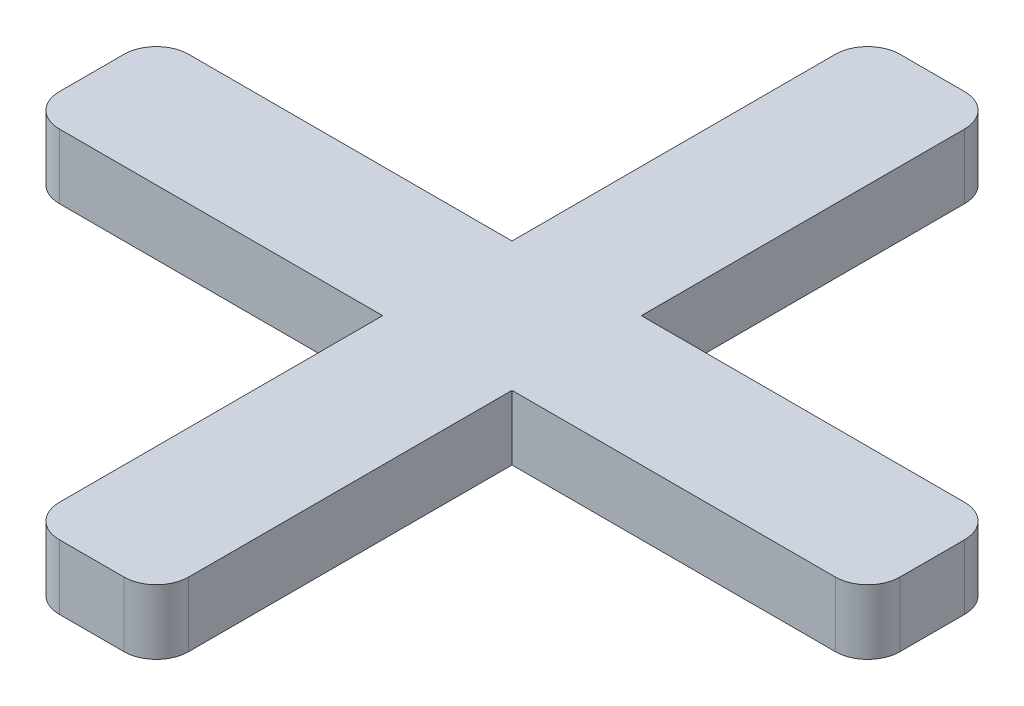
ISO-10303-21;
HEADER;
FILE_DESCRIPTION(('STEP AP214'),'2;1');
FILE_NAME('part.step','',(''),(''),'','','');
FILE_SCHEMA(('AUTOMOTIVE_DESIGN { 1 0 10303 214 1 1 1 1 }'));
ENDSEC;
DATA;
#1=APPLICATION_CONTEXT('core data for automotive mechanical design processes');
#2=APPLICATION_PROTOCOL_DEFINITION('international standard','automotive_design',2000,#1);
#3=PRODUCT_CONTEXT('',#1,'mechanical');
#4=PRODUCT('Part','Part','',(#3));
#5=PRODUCT_RELATED_PRODUCT_CATEGORY('part','',(#4));
#6=PRODUCT_DEFINITION_FORMATION('','',#4);
#7=PRODUCT_DEFINITION_CONTEXT('part definition',#1,'design');
#8=PRODUCT_DEFINITION('design','',#6,#7);
#9=PRODUCT_DEFINITION_SHAPE('','',#8);
#10=(LENGTH_UNIT() NAMED_UNIT(*) SI_UNIT(.MILLI.,.METRE.));
#11=(NAMED_UNIT(*) PLANE_ANGLE_UNIT() SI_UNIT($,.RADIAN.));
#12=(NAMED_UNIT(*) SI_UNIT($,.STERADIAN.) SOLID_ANGLE_UNIT());
#13=UNCERTAINTY_MEASURE_WITH_UNIT(LENGTH_MEASURE(1.E-05),#10,'distance_accuracy_value','');
#14=(GEOMETRIC_REPRESENTATION_CONTEXT(3) GLOBAL_UNCERTAINTY_ASSIGNED_CONTEXT((#13)) GLOBAL_UNIT_ASSIGNED_CONTEXT((#10,
#11,#12)) REPRESENTATION_CONTEXT('',''));
#15=CARTESIAN_POINT('',(0.,0.,0.));
#16=DIRECTION('',(0.,0.,1.));
#17=DIRECTION('',(1.,0.,0.));
#18=AXIS2_PLACEMENT_3D('',#15,#16,#17);
#19=CARTESIAN_POINT('',(-0.500000000000002,1.,-6.));
#20=DIRECTION('',(0.,-1.,0.));
#21=DIRECTION('',(0.,0.,-1.));
#22=AXIS2_PLACEMENT_3D('',#19,#20,#21);
#23=CYLINDRICAL_SURFACE('',#22,0.5);
#24=CARTESIAN_POINT('',(-0.500000000000002,0.,-6.));
#25=DIRECTION('',(0.,1.,0.));
#26=DIRECTION('',(0.,0.,-1.));
#27=AXIS2_PLACEMENT_3D('',#24,#25,#26);
#28=CIRCLE('',#27,0.5);
#29=CARTESIAN_POINT('',(-0.499999999999998,0.,-6.5));
#30=VERTEX_POINT('',#29);
#31=CARTESIAN_POINT('',(-1.,0.,-5.99999999999999));
#32=VERTEX_POINT('',#31);
#33=EDGE_CURVE('E218',#30,#32,#28,.T.);
#34=ORIENTED_EDGE('',*,*,#33,.T.);
#35=DIRECTION('',(0.,-1.,0.));
#36=VECTOR('',#35,1.);
#37=CARTESIAN_POINT('',(-1.,1.,-5.99999999999999));
#38=LINE('',#37,#36);
#39=CARTESIAN_POINT('',(-1.,1.,-5.99999999999999));
#40=VERTEX_POINT('',#39);
#41=EDGE_CURVE('E11',#40,#32,#38,.T.);
#42=ORIENTED_EDGE('',*,*,#41,.F.);
#43=CARTESIAN_POINT('',(-0.500000000000002,1.,-6.));
#44=DIRECTION('',(0.,1.,0.));
#45=DIRECTION('',(0.,0.,-1.));
#46=AXIS2_PLACEMENT_3D('',#43,#44,#45);
#47=CIRCLE('',#46,0.5);
#48=CARTESIAN_POINT('',(-0.499999999999998,1.,-6.5));
#49=VERTEX_POINT('',#48);
#50=EDGE_CURVE('E276',#49,#40,#47,.T.);
#51=ORIENTED_EDGE('',*,*,#50,.F.);
#52=DIRECTION('',(0.,-1.,0.));
#53=VECTOR('',#52,1.);
#54=CARTESIAN_POINT('',(-0.499999999999998,1.,-6.5));
#55=LINE('',#54,#53);
#56=EDGE_CURVE('E214',#49,#30,#55,.T.);
#57=ORIENTED_EDGE('',*,*,#56,.T.);
#58=EDGE_LOOP('',(#34,#42,#51,#57));
#59=FACE_BOUND('',#58,.T.);
#60=ADVANCED_FACE('F45',(#59),#23,.T.);
#61=CARTESIAN_POINT('',(-1.,1.,-1.));
#62=DIRECTION('',(1.,0.,0.));
#63=DIRECTION('',(0.,0.,-1.));
#64=AXIS2_PLACEMENT_3D('',#61,#62,#63);
#65=PLANE('',#64);
#66=DIRECTION('',(0.,0.,1.));
#67=VECTOR('',#66,1.);
#68=CARTESIAN_POINT('',(-1.,0.,-1.));
#69=LINE('',#68,#67);
#70=CARTESIAN_POINT('',(-1.,0.,-1.));
#71=VERTEX_POINT('',#70);
#72=EDGE_CURVE('E222',#32,#71,#69,.T.);
#73=ORIENTED_EDGE('',*,*,#72,.T.);
#74=DIRECTION('',(0.,-1.,0.));
#75=VECTOR('',#74,1.);
#76=CARTESIAN_POINT('',(-1.,1.,-1.));
#77=LINE('',#76,#75);
#78=CARTESIAN_POINT('',(-1.,1.,-1.));
#79=VERTEX_POINT('',#78);
#80=EDGE_CURVE('E54',#79,#71,#77,.T.);
#81=ORIENTED_EDGE('',*,*,#80,.F.);
#82=DIRECTION('',(0.,0.,1.));
#83=VECTOR('',#82,1.);
#84=CARTESIAN_POINT('',(-1.,1.,-1.));
#85=LINE('',#84,#83);
#86=EDGE_CURVE('E141',#40,#79,#85,.T.);
#87=ORIENTED_EDGE('',*,*,#86,.F.);
#88=ORIENTED_EDGE('',*,*,#41,.T.);
#89=EDGE_LOOP('',(#73,#81,#87,#88));
#90=FACE_BOUND('',#89,.T.);
#91=ADVANCED_FACE('F426',(#90),#65,.F.);
#92=CARTESIAN_POINT('',(-6.,1.,-1.));
#93=DIRECTION('',(0.,0.,1.));
#94=DIRECTION('',(1.,0.,0.));
#95=AXIS2_PLACEMENT_3D('',#92,#93,#94);
#96=PLANE('',#95);
#97=DIRECTION('',(-1.,0.,0.));
#98=VECTOR('',#97,1.);
#99=CARTESIAN_POINT('',(-6.,0.,-1.));
#100=LINE('',#99,#98);
#101=CARTESIAN_POINT('',(-6.,0.,-1.));
#102=VERTEX_POINT('',#101);
#103=EDGE_CURVE('E225',#71,#102,#100,.T.);
#104=ORIENTED_EDGE('',*,*,#103,.T.);
#105=DIRECTION('',(0.,-1.,0.));
#106=VECTOR('',#105,1.);
#107=CARTESIAN_POINT('',(-6.,1.,-1.));
#108=LINE('',#107,#106);
#109=CARTESIAN_POINT('',(-6.,1.,-1.));
#110=VERTEX_POINT('',#109);
#111=EDGE_CURVE('E335',#110,#102,#108,.T.);
#112=ORIENTED_EDGE('',*,*,#111,.F.);
#113=DIRECTION('',(-1.,0.,0.));
#114=VECTOR('',#113,1.);
#115=CARTESIAN_POINT('',(-6.,1.,-1.));
#116=LINE('',#115,#114);
#117=EDGE_CURVE('E345',#79,#110,#116,.T.);
#118=ORIENTED_EDGE('',*,*,#117,.F.);
#119=ORIENTED_EDGE('',*,*,#80,.T.);
#120=EDGE_LOOP('',(#104,#112,#118,#119));
#121=FACE_BOUND('',#120,.T.);
#122=ADVANCED_FACE('F343',(#121),#96,.F.);
#123=CARTESIAN_POINT('',(-6.,1.,-0.500000000000001));
#124=DIRECTION('',(0.,-1.,0.));
#125=DIRECTION('',(0.,0.,-1.));
#126=AXIS2_PLACEMENT_3D('',#123,#124,#125);
#127=CYLINDRICAL_SURFACE('',#126,0.5);
#128=CARTESIAN_POINT('',(-6.,0.,-0.500000000000001));
#129=DIRECTION('',(0.,1.,0.));
#130=DIRECTION('',(0.,0.,1.));
#131=AXIS2_PLACEMENT_3D('',#128,#129,#130);
#132=CIRCLE('',#131,0.5);
#133=CARTESIAN_POINT('',(-6.5,0.,-0.499999999999997));
#134=VERTEX_POINT('',#133);
#135=EDGE_CURVE('E228',#102,#134,#132,.T.);
#136=ORIENTED_EDGE('',*,*,#135,.T.);
#137=DIRECTION('',(0.,-1.,0.));
#138=VECTOR('',#137,1.);
#139=CARTESIAN_POINT('',(-6.5,1.,-0.499999999999997));
#140=LINE('',#139,#138);
#141=CARTESIAN_POINT('',(-6.5,1.,-0.499999999999997));
#142=VERTEX_POINT('',#141);
#143=EDGE_CURVE('E331',#142,#134,#140,.T.);
#144=ORIENTED_EDGE('',*,*,#143,.F.);
#145=CARTESIAN_POINT('',(-6.,1.,-0.500000000000001));
#146=DIRECTION('',(0.,1.,0.));
#147=DIRECTION('',(0.,0.,1.));
#148=AXIS2_PLACEMENT_3D('',#145,#146,#147);
#149=CIRCLE('',#148,0.5);
#150=EDGE_CURVE('E364',#110,#142,#149,.T.);
#151=ORIENTED_EDGE('',*,*,#150,.F.);
#152=ORIENTED_EDGE('',*,*,#111,.T.);
#153=EDGE_LOOP('',(#136,#144,#151,#152));
#154=FACE_BOUND('',#153,.T.);
#155=ADVANCED_FACE('F354',(#154),#127,.T.);
#156=CARTESIAN_POINT('',(-6.5,1.,-0.499999999999997));
#157=DIRECTION('',(1.,0.,0.));
#158=DIRECTION('',(0.,0.,-1.));
#159=AXIS2_PLACEMENT_3D('',#156,#157,#158);
#160=PLANE('',#159);
#161=DIRECTION('',(0.,0.,1.));
#162=VECTOR('',#161,1.);
#163=CARTESIAN_POINT('',(-6.5,0.,-0.499999999999997));
#164=LINE('',#163,#162);
#165=CARTESIAN_POINT('',(-6.5,0.,0.499999999999996));
#166=VERTEX_POINT('',#165);
#167=EDGE_CURVE('E231',#134,#166,#164,.T.);
#168=ORIENTED_EDGE('',*,*,#167,.T.);
#169=DIRECTION('',(0.,-1.,0.));
#170=VECTOR('',#169,1.);
#171=CARTESIAN_POINT('',(-6.5,1.,0.499999999999996));
#172=LINE('',#171,#170);
#173=CARTESIAN_POINT('',(-6.5,1.,0.499999999999996));
#174=VERTEX_POINT('',#173);
#175=EDGE_CURVE('E327',#174,#166,#172,.T.);
#176=ORIENTED_EDGE('',*,*,#175,.F.);
#177=DIRECTION('',(0.,0.,1.));
#178=VECTOR('',#177,1.);
#179=CARTESIAN_POINT('',(-6.5,1.,-0.499999999999997));
#180=LINE('',#179,#178);
#181=EDGE_CURVE('E360',#142,#174,#180,.T.);
#182=ORIENTED_EDGE('',*,*,#181,.F.);
#183=ORIENTED_EDGE('',*,*,#143,.T.);
#184=EDGE_LOOP('',(#168,#176,#182,#183));
#185=FACE_BOUND('',#184,.T.);
#186=ADVANCED_FACE('F358',(#185),#160,.F.);
#187=CARTESIAN_POINT('',(-6.,1.,0.5));
#188=DIRECTION('',(0.,-1.,0.));
#189=DIRECTION('',(0.,0.,-1.));
#190=AXIS2_PLACEMENT_3D('',#187,#188,#189);
#191=CYLINDRICAL_SURFACE('',#190,0.5);
#192=CARTESIAN_POINT('',(-6.,0.,0.5));
#193=DIRECTION('',(0.,1.,0.));
#194=DIRECTION('',(0.,0.,1.));
#195=AXIS2_PLACEMENT_3D('',#192,#193,#194);
#196=CIRCLE('',#195,0.5);
#197=CARTESIAN_POINT('',(-6.,0.,1.));
#198=VERTEX_POINT('',#197);
#199=EDGE_CURVE('E234',#166,#198,#196,.T.);
#200=ORIENTED_EDGE('',*,*,#199,.T.);
#201=DIRECTION('',(0.,-1.,0.));
#202=VECTOR('',#201,1.);
#203=CARTESIAN_POINT('',(-6.,1.,1.));
#204=LINE('',#203,#202);
#205=CARTESIAN_POINT('',(-6.,1.,1.));
#206=VERTEX_POINT('',#205);
#207=EDGE_CURVE('E323',#206,#198,#204,.T.);
#208=ORIENTED_EDGE('',*,*,#207,.F.);
#209=CARTESIAN_POINT('',(-6.,1.,0.5));
#210=DIRECTION('',(0.,1.,0.));
#211=DIRECTION('',(0.,0.,1.));
#212=AXIS2_PLACEMENT_3D('',#209,#210,#211);
#213=CIRCLE('',#212,0.5);
#214=EDGE_CURVE('E363',#174,#206,#213,.T.);
#215=ORIENTED_EDGE('',*,*,#214,.F.);
#216=ORIENTED_EDGE('',*,*,#175,.T.);
#217=EDGE_LOOP('',(#200,#208,#215,#216));
#218=FACE_BOUND('',#217,.T.);
#219=ADVANCED_FACE('F439',(#218),#191,.T.);
#220=CARTESIAN_POINT('',(-6.,1.,1.));
#221=DIRECTION('',(0.,0.,-1.));
#222=DIRECTION('',(-1.,0.,0.));
#223=AXIS2_PLACEMENT_3D('',#220,#221,#222);
#224=PLANE('',#223);
#225=DIRECTION('',(1.,0.,0.));
#226=VECTOR('',#225,1.);
#227=CARTESIAN_POINT('',(-6.,0.,1.));
#228=LINE('',#227,#226);
#229=CARTESIAN_POINT('',(-1.,0.,1.));
#230=VERTEX_POINT('',#229);
#231=EDGE_CURVE('E237',#198,#230,#228,.T.);
#232=ORIENTED_EDGE('',*,*,#231,.T.);
#233=DIRECTION('',(0.,-1.,0.));
#234=VECTOR('',#233,1.);
#235=CARTESIAN_POINT('',(-1.,1.,1.));
#236=LINE('',#235,#234);
#237=CARTESIAN_POINT('',(-1.,1.,1.));
#238=VERTEX_POINT('',#237);
#239=EDGE_CURVE('E319',#238,#230,#236,.T.);
#240=ORIENTED_EDGE('',*,*,#239,.F.);
#241=DIRECTION('',(1.,0.,0.));
#242=VECTOR('',#241,1.);
#243=CARTESIAN_POINT('',(-6.,1.,1.));
#244=LINE('',#243,#242);
#245=EDGE_CURVE('E368',#206,#238,#244,.T.);
#246=ORIENTED_EDGE('',*,*,#245,.F.);
#247=ORIENTED_EDGE('',*,*,#207,.T.);
#248=EDGE_LOOP('',(#232,#240,#246,#247));
#249=FACE_BOUND('',#248,.T.);
#250=ADVANCED_FACE('F442',(#249),#224,.F.);
#251=CARTESIAN_POINT('',(-1.,1.,6.));
#252=DIRECTION('',(1.,0.,0.));
#253=DIRECTION('',(0.,0.,-1.));
#254=AXIS2_PLACEMENT_3D('',#251,#252,#253);
#255=PLANE('',#254);
#256=DIRECTION('',(0.,0.,1.));
#257=VECTOR('',#256,1.);
#258=CARTESIAN_POINT('',(-1.,0.,6.));
#259=LINE('',#258,#257);
#260=CARTESIAN_POINT('',(-1.,0.,6.));
#261=VERTEX_POINT('',#260);
#262=EDGE_CURVE('E240',#230,#261,#259,.T.);
#263=ORIENTED_EDGE('',*,*,#262,.T.);
#264=DIRECTION('',(0.,-1.,0.));
#265=VECTOR('',#264,1.);
#266=CARTESIAN_POINT('',(-1.,1.,6.));
#267=LINE('',#266,#265);
#268=CARTESIAN_POINT('',(-1.,1.,6.));
#269=VERTEX_POINT('',#268);
#270=EDGE_CURVE('E315',#269,#261,#267,.T.);
#271=ORIENTED_EDGE('',*,*,#270,.F.);
#272=DIRECTION('',(0.,0.,1.));
#273=VECTOR('',#272,1.);
#274=CARTESIAN_POINT('',(-1.,1.,6.));
#275=LINE('',#274,#273);
#276=EDGE_CURVE('E375',#238,#269,#275,.T.);
#277=ORIENTED_EDGE('',*,*,#276,.F.);
#278=ORIENTED_EDGE('',*,*,#239,.T.);
#279=EDGE_LOOP('',(#263,#271,#277,#278));
#280=FACE_BOUND('',#279,.T.);
#281=ADVANCED_FACE('F446',(#280),#255,.F.);
#282=CARTESIAN_POINT('',(-0.500000000000002,1.,6.));
#283=DIRECTION('',(0.,-1.,0.));
#284=DIRECTION('',(0.,0.,-1.));
#285=AXIS2_PLACEMENT_3D('',#282,#283,#284);
#286=CYLINDRICAL_SURFACE('',#285,0.5);
#287=CARTESIAN_POINT('',(-0.500000000000002,0.,6.));
#288=DIRECTION('',(0.,1.,0.));
#289=DIRECTION('',(0.,0.,-1.));
#290=AXIS2_PLACEMENT_3D('',#287,#288,#289);
#291=CIRCLE('',#290,0.5);
#292=CARTESIAN_POINT('',(-0.499999999999998,0.,6.5));
#293=VERTEX_POINT('',#292);
#294=EDGE_CURVE('E243',#261,#293,#291,.T.);
#295=ORIENTED_EDGE('',*,*,#294,.T.);
#296=DIRECTION('',(0.,-1.,0.));
#297=VECTOR('',#296,1.);
#298=CARTESIAN_POINT('',(-0.499999999999998,1.,6.5));
#299=LINE('',#298,#297);
#300=CARTESIAN_POINT('',(-0.499999999999998,1.,6.5));
#301=VERTEX_POINT('',#300);
#302=EDGE_CURVE('E311',#301,#293,#299,.T.);
#303=ORIENTED_EDGE('',*,*,#302,.F.);
#304=CARTESIAN_POINT('',(-0.500000000000002,1.,6.));
#305=DIRECTION('',(0.,1.,0.));
#306=DIRECTION('',(0.,0.,-1.));
#307=AXIS2_PLACEMENT_3D('',#304,#305,#306);
#308=CIRCLE('',#307,0.5);
#309=EDGE_CURVE('E378',#269,#301,#308,.T.);
#310=ORIENTED_EDGE('',*,*,#309,.F.);
#311=ORIENTED_EDGE('',*,*,#270,.T.);
#312=EDGE_LOOP('',(#295,#303,#310,#311));
#313=FACE_BOUND('',#312,.T.);
#314=ADVANCED_FACE('F450',(#313),#286,.T.);
#315=CARTESIAN_POINT('',(-0.499999999999998,1.,6.5));
#316=DIRECTION('',(0.,0.,-1.));
#317=DIRECTION('',(-1.,0.,0.));
#318=AXIS2_PLACEMENT_3D('',#315,#316,#317);
#319=PLANE('',#318);
#320=DIRECTION('',(1.,0.,0.));
#321=VECTOR('',#320,1.);
#322=CARTESIAN_POINT('',(-0.499999999999998,0.,6.5));
#323=LINE('',#322,#321);
#324=CARTESIAN_POINT('',(0.499999999999995,0.,6.5));
#325=VERTEX_POINT('',#324);
#326=EDGE_CURVE('E246',#293,#325,#323,.T.);
#327=ORIENTED_EDGE('',*,*,#326,.T.);
#328=DIRECTION('',(0.,-1.,0.));
#329=VECTOR('',#328,1.);
#330=CARTESIAN_POINT('',(0.499999999999995,1.,6.5));
#331=LINE('',#330,#329);
#332=CARTESIAN_POINT('',(0.499999999999995,1.,6.5));
#333=VERTEX_POINT('',#332);
#334=EDGE_CURVE('E307',#333,#325,#331,.T.);
#335=ORIENTED_EDGE('',*,*,#334,.F.);
#336=DIRECTION('',(1.,0.,0.));
#337=VECTOR('',#336,1.);
#338=CARTESIAN_POINT('',(-0.499999999999998,1.,6.5));
#339=LINE('',#338,#337);
#340=EDGE_CURVE('E381',#301,#333,#339,.T.);
#341=ORIENTED_EDGE('',*,*,#340,.F.);
#342=ORIENTED_EDGE('',*,*,#302,.T.);
#343=EDGE_LOOP('',(#327,#335,#341,#342));
#344=FACE_BOUND('',#343,.T.);
#345=ADVANCED_FACE('F454',(#344),#319,.F.);
#346=CARTESIAN_POINT('',(0.499999999999999,1.,6.));
#347=DIRECTION('',(0.,-1.,0.));
#348=DIRECTION('',(0.,0.,-1.));
#349=AXIS2_PLACEMENT_3D('',#346,#347,#348);
#350=CYLINDRICAL_SURFACE('',#349,0.5);
#351=CARTESIAN_POINT('',(0.499999999999999,0.,6.));
#352=DIRECTION('',(0.,1.,0.));
#353=DIRECTION('',(0.,0.,1.));
#354=AXIS2_PLACEMENT_3D('',#351,#352,#353);
#355=CIRCLE('',#354,0.5);
#356=CARTESIAN_POINT('',(0.999999999999998,0.,6.));
#357=VERTEX_POINT('',#356);
#358=EDGE_CURVE('E249',#325,#357,#355,.T.);
#359=ORIENTED_EDGE('',*,*,#358,.T.);
#360=DIRECTION('',(0.,-1.,0.));
#361=VECTOR('',#360,1.);
#362=CARTESIAN_POINT('',(0.999999999999998,1.,6.));
#363=LINE('',#362,#361);
#364=CARTESIAN_POINT('',(0.999999999999998,1.,6.));
#365=VERTEX_POINT('',#364);
#366=EDGE_CURVE('E303',#365,#357,#363,.T.);
#367=ORIENTED_EDGE('',*,*,#366,.F.);
#368=CARTESIAN_POINT('',(0.499999999999999,1.,6.));
#369=DIRECTION('',(0.,1.,0.));
#370=DIRECTION('',(0.,0.,1.));
#371=AXIS2_PLACEMENT_3D('',#368,#369,#370);
#372=CIRCLE('',#371,0.5);
#373=EDGE_CURVE('E384',#333,#365,#372,.T.);
#374=ORIENTED_EDGE('',*,*,#373,.F.);
#375=ORIENTED_EDGE('',*,*,#334,.T.);
#376=EDGE_LOOP('',(#359,#367,#374,#375));
#377=FACE_BOUND('',#376,.T.);
#378=ADVANCED_FACE('F458',(#377),#350,.T.);
#379=CARTESIAN_POINT('',(0.999999999999999,1.,6.));
#380=DIRECTION('',(-1.,0.,0.));
#381=DIRECTION('',(0.,0.,1.));
#382=AXIS2_PLACEMENT_3D('',#379,#380,#381);
#383=PLANE('',#382);
#384=DIRECTION('',(0.,0.,-1.));
#385=VECTOR('',#384,1.);
#386=CARTESIAN_POINT('',(0.999999999999999,0.,6.));
#387=LINE('',#386,#385);
#388=CARTESIAN_POINT('',(0.999999999999997,0.,0.999999999999999));
#389=VERTEX_POINT('',#388);
#390=EDGE_CURVE('E252',#357,#389,#387,.T.);
#391=ORIENTED_EDGE('',*,*,#390,.T.);
#392=DIRECTION('',(0.,-1.,0.));
#393=VECTOR('',#392,1.);
#394=CARTESIAN_POINT('',(0.999999999999997,1.,0.999999999999999));
#395=LINE('',#394,#393);
#396=CARTESIAN_POINT('',(0.999999999999997,1.,0.999999999999999));
#397=VERTEX_POINT('',#396);
#398=EDGE_CURVE('E299',#397,#389,#395,.T.);
#399=ORIENTED_EDGE('',*,*,#398,.F.);
#400=DIRECTION('',(0.,0.,-1.));
#401=VECTOR('',#400,1.);
#402=CARTESIAN_POINT('',(0.999999999999999,1.,6.));
#403=LINE('',#402,#401);
#404=EDGE_CURVE('E387',#365,#397,#403,.T.);
#405=ORIENTED_EDGE('',*,*,#404,.F.);
#406=ORIENTED_EDGE('',*,*,#366,.T.);
#407=EDGE_LOOP('',(#391,#399,#405,#406));
#408=FACE_BOUND('',#407,.T.);
#409=ADVANCED_FACE('F462',(#408),#383,.F.);
#410=CARTESIAN_POINT('',(0.999999999999997,1.,0.999999999999999));
#411=DIRECTION('',(0.,0.,-1.));
#412=DIRECTION('',(-1.,0.,0.));
#413=AXIS2_PLACEMENT_3D('',#410,#411,#412);
#414=PLANE('',#413);
#415=DIRECTION('',(1.,0.,0.));
#416=VECTOR('',#415,1.);
#417=CARTESIAN_POINT('',(0.999999999999997,0.,0.999999999999999));
#418=LINE('',#417,#416);
#419=CARTESIAN_POINT('',(5.99999999999999,0.,1.));
#420=VERTEX_POINT('',#419);
#421=EDGE_CURVE('E255',#389,#420,#418,.T.);
#422=ORIENTED_EDGE('',*,*,#421,.T.);
#423=DIRECTION('',(0.,-1.,0.));
#424=VECTOR('',#423,1.);
#425=CARTESIAN_POINT('',(5.99999999999999,1.,1.));
#426=LINE('',#425,#424);
#427=CARTESIAN_POINT('',(5.99999999999999,1.,1.));
#428=VERTEX_POINT('',#427);
#429=EDGE_CURVE('E295',#428,#420,#426,.T.);
#430=ORIENTED_EDGE('',*,*,#429,.F.);
#431=DIRECTION('',(1.,0.,0.));
#432=VECTOR('',#431,1.);
#433=CARTESIAN_POINT('',(0.999999999999997,1.,0.999999999999999));
#434=LINE('',#433,#432);
#435=EDGE_CURVE('E390',#397,#428,#434,.T.);
#436=ORIENTED_EDGE('',*,*,#435,.F.);
#437=ORIENTED_EDGE('',*,*,#398,.T.);
#438=EDGE_LOOP('',(#422,#430,#436,#437));
#439=FACE_BOUND('',#438,.T.);
#440=ADVANCED_FACE('F466',(#439),#414,.F.);
#441=CARTESIAN_POINT('',(6.,1.,0.5));
#442=DIRECTION('',(0.,-1.,0.));
#443=DIRECTION('',(0.,0.,-1.));
#444=AXIS2_PLACEMENT_3D('',#441,#442,#443);
#445=CYLINDRICAL_SURFACE('',#444,0.5);
#446=CARTESIAN_POINT('',(6.,0.,0.5));
#447=DIRECTION('',(0.,1.,0.));
#448=DIRECTION('',(0.,0.,1.));
#449=AXIS2_PLACEMENT_3D('',#446,#447,#448);
#450=CIRCLE('',#449,0.5);
#451=CARTESIAN_POINT('',(6.5,0.,0.499999999999997));
#452=VERTEX_POINT('',#451);
#453=EDGE_CURVE('E258',#420,#452,#450,.T.);
#454=ORIENTED_EDGE('',*,*,#453,.T.);
#455=DIRECTION('',(0.,-1.,0.));
#456=VECTOR('',#455,1.);
#457=CARTESIAN_POINT('',(6.5,1.,0.499999999999997));
#458=LINE('',#457,#456);
#459=CARTESIAN_POINT('',(6.5,1.,0.499999999999997));
#460=VERTEX_POINT('',#459);
#461=EDGE_CURVE('E291',#460,#452,#458,.T.);
#462=ORIENTED_EDGE('',*,*,#461,.F.);
#463=CARTESIAN_POINT('',(6.,1.,0.5));
#464=DIRECTION('',(0.,1.,0.));
#465=DIRECTION('',(0.,0.,1.));
#466=AXIS2_PLACEMENT_3D('',#463,#464,#465);
#467=CIRCLE('',#466,0.5);
#468=EDGE_CURVE('E393',#428,#460,#467,.T.);
#469=ORIENTED_EDGE('',*,*,#468,.F.);
#470=ORIENTED_EDGE('',*,*,#429,.T.);
#471=EDGE_LOOP('',(#454,#462,#469,#470));
#472=FACE_BOUND('',#471,.T.);
#473=ADVANCED_FACE('F470',(#472),#445,.T.);
#474=CARTESIAN_POINT('',(6.5,1.,-0.499999999999997));
#475=DIRECTION('',(-1.,0.,0.));
#476=DIRECTION('',(0.,0.,1.));
#477=AXIS2_PLACEMENT_3D('',#474,#475,#476);
#478=PLANE('',#477);
#479=DIRECTION('',(0.,0.,-1.));
#480=VECTOR('',#479,1.);
#481=CARTESIAN_POINT('',(6.5,0.,-0.499999999999997));
#482=LINE('',#481,#480);
#483=CARTESIAN_POINT('',(6.5,0.,-0.499999999999997));
#484=VERTEX_POINT('',#483);
#485=EDGE_CURVE('E261',#452,#484,#482,.T.);
#486=ORIENTED_EDGE('',*,*,#485,.T.);
#487=DIRECTION('',(0.,-1.,0.));
#488=VECTOR('',#487,1.);
#489=CARTESIAN_POINT('',(6.5,1.,-0.499999999999997));
#490=LINE('',#489,#488);
#491=CARTESIAN_POINT('',(6.5,1.,-0.499999999999997));
#492=VERTEX_POINT('',#491);
#493=EDGE_CURVE('E287',#492,#484,#490,.T.);
#494=ORIENTED_EDGE('',*,*,#493,.F.);
#495=DIRECTION('',(0.,0.,-1.));
#496=VECTOR('',#495,1.);
#497=CARTESIAN_POINT('',(6.5,1.,-0.499999999999997));
#498=LINE('',#497,#496);
#499=EDGE_CURVE('E396',#460,#492,#498,.T.);
#500=ORIENTED_EDGE('',*,*,#499,.F.);
#501=ORIENTED_EDGE('',*,*,#461,.T.);
#502=EDGE_LOOP('',(#486,#494,#500,#501));
#503=FACE_BOUND('',#502,.T.);
#504=ADVANCED_FACE('F474',(#503),#478,.F.);
#505=CARTESIAN_POINT('',(6.,1.,-0.5));
#506=DIRECTION('',(0.,-1.,0.));
#507=DIRECTION('',(0.,0.,-1.));
#508=AXIS2_PLACEMENT_3D('',#505,#506,#507);
#509=CYLINDRICAL_SURFACE('',#508,0.5);
#510=CARTESIAN_POINT('',(6.,0.,-0.5));
#511=DIRECTION('',(0.,1.,0.));
#512=DIRECTION('',(0.,0.,-1.));
#513=AXIS2_PLACEMENT_3D('',#510,#511,#512);
#514=CIRCLE('',#513,0.5);
#515=CARTESIAN_POINT('',(5.99999999999999,0.,-1.));
#516=VERTEX_POINT('',#515);
#517=EDGE_CURVE('E264',#484,#516,#514,.T.);
#518=ORIENTED_EDGE('',*,*,#517,.T.);
#519=DIRECTION('',(0.,-1.,0.));
#520=VECTOR('',#519,1.);
#521=CARTESIAN_POINT('',(5.99999999999999,1.,-1.));
#522=LINE('',#521,#520);
#523=CARTESIAN_POINT('',(5.99999999999999,1.,-1.));
#524=VERTEX_POINT('',#523);
#525=EDGE_CURVE('E283',#524,#516,#522,.T.);
#526=ORIENTED_EDGE('',*,*,#525,.F.);
#527=CARTESIAN_POINT('',(6.,1.,-0.5));
#528=DIRECTION('',(0.,1.,0.));
#529=DIRECTION('',(0.,0.,-1.));
#530=AXIS2_PLACEMENT_3D('',#527,#528,#529);
#531=CIRCLE('',#530,0.5);
#532=EDGE_CURVE('E399',#492,#524,#531,.T.);
#533=ORIENTED_EDGE('',*,*,#532,.F.);
#534=ORIENTED_EDGE('',*,*,#493,.T.);
#535=EDGE_LOOP('',(#518,#526,#533,#534));
#536=FACE_BOUND('',#535,.T.);
#537=ADVANCED_FACE('F407',(#536),#509,.T.);
#538=CARTESIAN_POINT('',(0.999999999999998,1.,-1.));
#539=DIRECTION('',(0.,0.,1.));
#540=DIRECTION('',(1.,0.,0.));
#541=AXIS2_PLACEMENT_3D('',#538,#539,#540);
#542=PLANE('',#541);
#543=DIRECTION('',(-1.,0.,0.));
#544=VECTOR('',#543,1.);
#545=CARTESIAN_POINT('',(0.999999999999998,0.,-1.));
#546=LINE('',#545,#544);
#547=CARTESIAN_POINT('',(0.999999999999998,0.,-1.));
#548=VERTEX_POINT('',#547);
#549=EDGE_CURVE('E267',#516,#548,#546,.T.);
#550=ORIENTED_EDGE('',*,*,#549,.T.);
#551=DIRECTION('',(0.,-1.,0.));
#552=VECTOR('',#551,1.);
#553=CARTESIAN_POINT('',(0.999999999999998,1.,-1.));
#554=LINE('',#553,#552);
#555=CARTESIAN_POINT('',(0.999999999999998,1.,-1.));
#556=VERTEX_POINT('',#555);
#557=EDGE_CURVE('E207',#556,#548,#554,.T.);
#558=ORIENTED_EDGE('',*,*,#557,.F.);
#559=DIRECTION('',(-1.,0.,0.));
#560=VECTOR('',#559,1.);
#561=CARTESIAN_POINT('',(0.999999999999998,1.,-1.));
#562=LINE('',#561,#560);
#563=EDGE_CURVE('E196',#524,#556,#562,.T.);
#564=ORIENTED_EDGE('',*,*,#563,.F.);
#565=ORIENTED_EDGE('',*,*,#525,.T.);
#566=EDGE_LOOP('',(#550,#558,#564,#565));
#567=FACE_BOUND('',#566,.T.);
#568=ADVANCED_FACE('F411',(#567),#542,.F.);
#569=CARTESIAN_POINT('',(0.999999999999998,1.,-1.));
#570=DIRECTION('',(-1.,0.,0.));
#571=DIRECTION('',(0.,0.,1.));
#572=AXIS2_PLACEMENT_3D('',#569,#570,#571);
#573=PLANE('',#572);
#574=DIRECTION('',(0.,0.,-1.));
#575=VECTOR('',#574,1.);
#576=CARTESIAN_POINT('',(0.999999999999998,0.,-1.));
#577=LINE('',#576,#575);
#578=CARTESIAN_POINT('',(0.999999999999999,0.,-5.99999999999999));
#579=VERTEX_POINT('',#578);
#580=EDGE_CURVE('E205',#548,#579,#577,.T.);
#581=ORIENTED_EDGE('',*,*,#580,.T.);
#582=DIRECTION('',(0.,-1.,0.));
#583=VECTOR('',#582,1.);
#584=CARTESIAN_POINT('',(0.999999999999999,1.,-5.99999999999999));
#585=LINE('',#584,#583);
#586=CARTESIAN_POINT('',(0.999999999999999,1.,-5.99999999999999));
#587=VERTEX_POINT('',#586);
#588=EDGE_CURVE('E202',#587,#579,#585,.T.);
#589=ORIENTED_EDGE('',*,*,#588,.F.);
#590=DIRECTION('',(0.,0.,-1.));
#591=VECTOR('',#590,1.);
#592=CARTESIAN_POINT('',(0.999999999999998,1.,-1.));
#593=LINE('',#592,#591);
#594=EDGE_CURVE('E190',#556,#587,#593,.T.);
#595=ORIENTED_EDGE('',*,*,#594,.F.);
#596=ORIENTED_EDGE('',*,*,#557,.T.);
#597=EDGE_LOOP('',(#581,#589,#595,#596));
#598=FACE_BOUND('',#597,.T.);
#599=ADVANCED_FACE('F203',(#598),#573,.F.);
#600=CARTESIAN_POINT('',(0.499999999999999,1.,-6.));
#601=DIRECTION('',(0.,-1.,0.));
#602=DIRECTION('',(0.,0.,-1.));
#603=AXIS2_PLACEMENT_3D('',#600,#601,#602);
#604=CYLINDRICAL_SURFACE('',#603,0.5);
#605=CARTESIAN_POINT('',(0.499999999999999,0.,-6.));
#606=DIRECTION('',(0.,1.,0.));
#607=DIRECTION('',(0.,0.,-1.));
#608=AXIS2_PLACEMENT_3D('',#605,#606,#607);
#609=CIRCLE('',#608,0.5);
#610=CARTESIAN_POINT('',(0.499999999999995,0.,-6.5));
#611=VERTEX_POINT('',#610);
#612=EDGE_CURVE('E127',#579,#611,#609,.T.);
#613=ORIENTED_EDGE('',*,*,#612,.T.);
#614=DIRECTION('',(0.,-1.,0.));
#615=VECTOR('',#614,1.);
#616=CARTESIAN_POINT('',(0.499999999999995,1.,-6.5));
#617=LINE('',#616,#615);
#618=CARTESIAN_POINT('',(0.499999999999995,1.,-6.5));
#619=VERTEX_POINT('',#618);
#620=EDGE_CURVE('E208',#619,#611,#617,.T.);
#621=ORIENTED_EDGE('',*,*,#620,.F.);
#622=CARTESIAN_POINT('',(0.499999999999999,1.,-6.));
#623=DIRECTION('',(0.,1.,0.));
#624=DIRECTION('',(0.,0.,-1.));
#625=AXIS2_PLACEMENT_3D('',#622,#623,#624);
#626=CIRCLE('',#625,0.5);
#627=EDGE_CURVE('E194',#587,#619,#626,.T.);
#628=ORIENTED_EDGE('',*,*,#627,.F.);
#629=ORIENTED_EDGE('',*,*,#588,.T.);
#630=EDGE_LOOP('',(#613,#621,#628,#629));
#631=FACE_BOUND('',#630,.T.);
#632=ADVANCED_FACE('F210',(#631),#604,.T.);
#633=CARTESIAN_POINT('',(-0.499999999999998,1.,-6.5));
#634=DIRECTION('',(0.,0.,1.));
#635=DIRECTION('',(1.,0.,0.));
#636=AXIS2_PLACEMENT_3D('',#633,#634,#635);
#637=PLANE('',#636);
#638=DIRECTION('',(-1.,0.,0.));
#639=VECTOR('',#638,1.);
#640=CARTESIAN_POINT('',(-0.499999999999998,0.,-6.5));
#641=LINE('',#640,#639);
#642=EDGE_CURVE('E133',#611,#30,#641,.T.);
#643=ORIENTED_EDGE('',*,*,#642,.T.);
#644=ORIENTED_EDGE('',*,*,#56,.F.);
#645=DIRECTION('',(-1.,0.,0.));
#646=VECTOR('',#645,1.);
#647=CARTESIAN_POINT('',(-0.499999999999998,1.,-6.5));
#648=LINE('',#647,#646);
#649=EDGE_CURVE('E62',#619,#49,#648,.T.);
#650=ORIENTED_EDGE('',*,*,#649,.F.);
#651=ORIENTED_EDGE('',*,*,#620,.T.);
#652=EDGE_LOOP('',(#643,#644,#650,#651));
#653=FACE_BOUND('',#652,.T.);
#654=ADVANCED_FACE('F415',(#653),#637,.F.);
#655=CARTESIAN_POINT('',(-0.500000000000002,1.,-6.));
#656=DIRECTION('',(0.,-1.,0.));
#657=DIRECTION('',(0.,0.,-1.));
#658=AXIS2_PLACEMENT_3D('',#655,#656,#657);
#659=PLANE('',#658);
#660=ORIENTED_EDGE('',*,*,#50,.T.);
#661=ORIENTED_EDGE('',*,*,#86,.T.);
#662=ORIENTED_EDGE('',*,*,#117,.T.);
#663=ORIENTED_EDGE('',*,*,#150,.T.);
#664=ORIENTED_EDGE('',*,*,#181,.T.);
#665=ORIENTED_EDGE('',*,*,#214,.T.);
#666=ORIENTED_EDGE('',*,*,#245,.T.);
#667=ORIENTED_EDGE('',*,*,#276,.T.);
#668=ORIENTED_EDGE('',*,*,#309,.T.);
#669=ORIENTED_EDGE('',*,*,#340,.T.);
#670=ORIENTED_EDGE('',*,*,#373,.T.);
#671=ORIENTED_EDGE('',*,*,#404,.T.);
#672=ORIENTED_EDGE('',*,*,#435,.T.);
#673=ORIENTED_EDGE('',*,*,#468,.T.);
#674=ORIENTED_EDGE('',*,*,#499,.T.);
#675=ORIENTED_EDGE('',*,*,#532,.T.);
#676=ORIENTED_EDGE('',*,*,#563,.T.);
#677=ORIENTED_EDGE('',*,*,#594,.T.);
#678=ORIENTED_EDGE('',*,*,#627,.T.);
#679=ORIENTED_EDGE('',*,*,#649,.T.);
#680=EDGE_LOOP('',(#660,#661,#662,#663,#664,#665,#666,#667,#668,#669,#670,#671,#672,#673,#674,
#675,#676,#677,#678,#679));
#681=FACE_BOUND('',#680,.T.);
#682=ADVANCED_FACE('F192',(#681),#659,.F.);
#683=CARTESIAN_POINT('',(-0.500000000000002,0.,-6.));
#684=DIRECTION('',(0.,-1.,0.));
#685=DIRECTION('',(0.,0.,-1.));
#686=AXIS2_PLACEMENT_3D('',#683,#684,#685);
#687=PLANE('',#686);
#688=ORIENTED_EDGE('',*,*,#33,.F.);
#689=ORIENTED_EDGE('',*,*,#642,.F.);
#690=ORIENTED_EDGE('',*,*,#612,.F.);
#691=ORIENTED_EDGE('',*,*,#580,.F.);
#692=ORIENTED_EDGE('',*,*,#549,.F.);
#693=ORIENTED_EDGE('',*,*,#517,.F.);
#694=ORIENTED_EDGE('',*,*,#485,.F.);
#695=ORIENTED_EDGE('',*,*,#453,.F.);
#696=ORIENTED_EDGE('',*,*,#421,.F.);
#697=ORIENTED_EDGE('',*,*,#390,.F.);
#698=ORIENTED_EDGE('',*,*,#358,.F.);
#699=ORIENTED_EDGE('',*,*,#326,.F.);
#700=ORIENTED_EDGE('',*,*,#294,.F.);
#701=ORIENTED_EDGE('',*,*,#262,.F.);
#702=ORIENTED_EDGE('',*,*,#231,.F.);
#703=ORIENTED_EDGE('',*,*,#199,.F.);
#704=ORIENTED_EDGE('',*,*,#167,.F.);
#705=ORIENTED_EDGE('',*,*,#135,.F.);
#706=ORIENTED_EDGE('',*,*,#103,.F.);
#707=ORIENTED_EDGE('',*,*,#72,.F.);
#708=EDGE_LOOP('',(#688,#689,#690,#691,#692,#693,#694,#695,#696,#697,#698,#699,#700,#701,#702,
#703,#704,#705,#706,#707));
#709=FACE_BOUND('',#708,.T.);
#710=ADVANCED_FACE('F349',(#709),#687,.T.);
#711=CLOSED_SHELL('',(#60,#91,#122,#155,#186,#219,#250,#281,#314,#345,#378,#409,#440,#473,#504,
#537,#568,#599,#632,#654,#682,#710));
#712=MANIFOLD_SOLID_BREP('B2',#711);
#713=ADVANCED_BREP_SHAPE_REPRESENTATION('',(#18,#712),#14);
#714=SHAPE_DEFINITION_REPRESENTATION(#9,#713);
ENDSEC;
END-ISO-10303-21;
